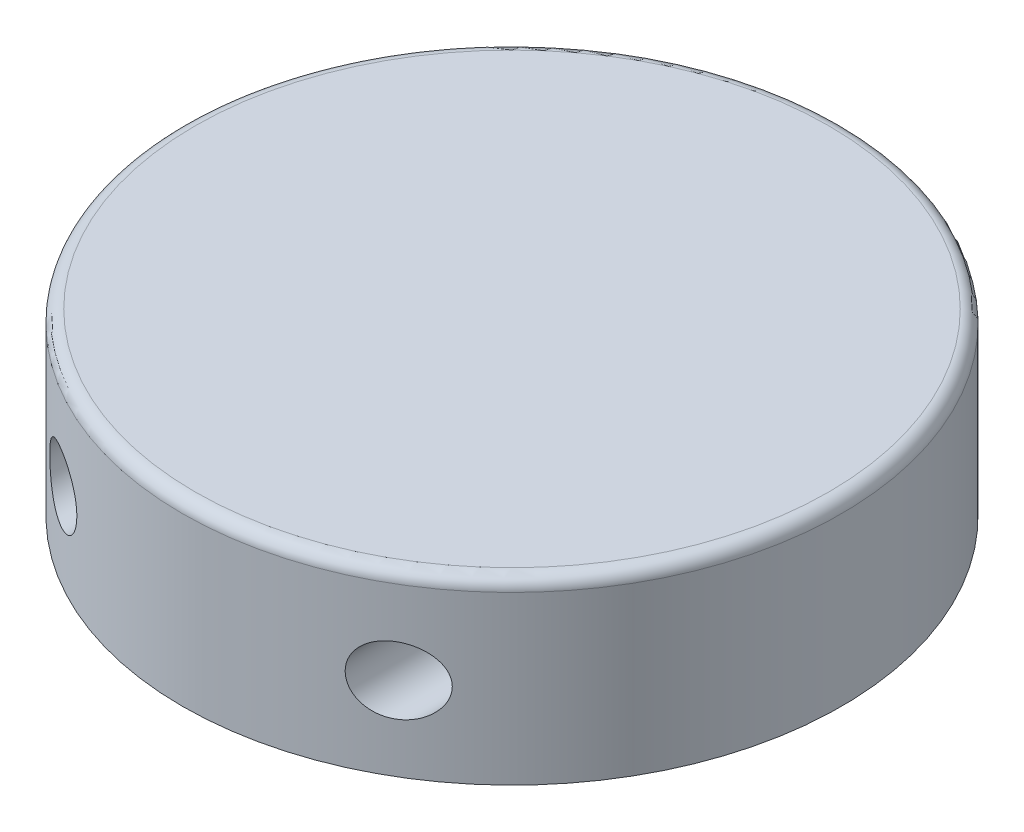
ISO-10303-21;
HEADER;
FILE_DESCRIPTION(('STEP AP214'),'2;1');
FILE_NAME('part.step','',(''),(''),'','','');
FILE_SCHEMA(('AUTOMOTIVE_DESIGN { 1 0 10303 214 1 1 1 1 }'));
ENDSEC;
DATA;
#1=APPLICATION_CONTEXT('core data for automotive mechanical design processes');
#2=APPLICATION_PROTOCOL_DEFINITION('international standard','automotive_design',2000,#1);
#3=PRODUCT_CONTEXT('',#1,'mechanical');
#4=PRODUCT('Part','Part','',(#3));
#5=PRODUCT_RELATED_PRODUCT_CATEGORY('part','',(#4));
#6=PRODUCT_DEFINITION_FORMATION('','',#4);
#7=PRODUCT_DEFINITION_CONTEXT('part definition',#1,'design');
#8=PRODUCT_DEFINITION('design','',#6,#7);
#9=PRODUCT_DEFINITION_SHAPE('','',#8);
#10=(LENGTH_UNIT() NAMED_UNIT(*) SI_UNIT(.MILLI.,.METRE.));
#11=(NAMED_UNIT(*) PLANE_ANGLE_UNIT() SI_UNIT($,.RADIAN.));
#12=(NAMED_UNIT(*) SI_UNIT($,.STERADIAN.) SOLID_ANGLE_UNIT());
#13=UNCERTAINTY_MEASURE_WITH_UNIT(LENGTH_MEASURE(1.E-05),#10,'distance_accuracy_value','');
#14=(GEOMETRIC_REPRESENTATION_CONTEXT(3) GLOBAL_UNCERTAINTY_ASSIGNED_CONTEXT((#13)) GLOBAL_UNIT_ASSIGNED_CONTEXT((#10,
#11,#12)) REPRESENTATION_CONTEXT('',''));
#15=CARTESIAN_POINT('',(0.,0.,0.));
#16=DIRECTION('',(0.,0.,1.));
#17=DIRECTION('',(1.,0.,0.));
#18=AXIS2_PLACEMENT_3D('',#15,#16,#17);
#19=CARTESIAN_POINT('',(0.,21.4,0.));
#20=DIRECTION('',(0.,-1.,0.));
#21=DIRECTION('',(0.,0.,-1.));
#22=AXIS2_PLACEMENT_3D('',#19,#20,#21);
#23=CYLINDRICAL_SURFACE('',#22,39.3);
#24=CARTESIAN_POINT('',(24.,9.94999999999997,31.1205719741781));
#25=CARTESIAN_POINT('',(24.0000004367337,9.75702235025103,31.1205716483451));
#26=CARTESIAN_POINT('',(23.9859498878768,9.56404571600808,31.1314224845735));
#27=CARTESIAN_POINT('',(23.9307323153177,9.18437149414656,31.1738868124886));
#28=CARTESIAN_POINT('',(23.889554633807,8.99767640475851,31.2055084646763));
#29=CARTESIAN_POINT('',(23.7829266022278,8.63670399423492,31.2868473359323));
#30=CARTESIAN_POINT('',(23.7175976432236,8.46236968013503,31.3364740337929));
#31=CARTESIAN_POINT('',(23.56591285891,8.12848015842301,31.4507032763606));
#32=CARTESIAN_POINT('',(23.4795504893609,7.9689295719222,31.5153104817342));
#33=CARTESIAN_POINT('',(23.2810537998613,7.65386834507642,31.6622644846472));
#34=CARTESIAN_POINT('',(23.1673608424185,7.49983155229876,31.7456474743854));
#35=CARTESIAN_POINT('',(22.9228514518291,7.21274960495519,31.9226517859381));
#36=CARTESIAN_POINT('',(22.7920271726797,7.0797141307694,32.016277795718));
#37=CARTESIAN_POINT('',(22.4886637812432,6.81065461097024,32.2302796034445));
#38=CARTESIAN_POINT('',(22.3130230727105,6.6793937134958,32.3522518750715));
#39=CARTESIAN_POINT('',(21.94598573118,6.44854278442323,32.6023487306357));
#40=CARTESIAN_POINT('',(21.7545776645915,6.34897599464994,32.7304777505384));
#41=CARTESIAN_POINT('',(21.3275209999802,6.16848395247953,33.0106375022933));
#42=CARTESIAN_POINT('',(21.0897588773783,6.09327668944546,33.1631480130952));
#43=CARTESIAN_POINT('',(20.6036253190854,5.98799899532425,33.4673383585911));
#44=CARTESIAN_POINT('',(20.3552486839697,5.95795095186154,33.6190177441569));
#45=CARTESIAN_POINT('',(19.9725838712759,5.94790055574151,33.8468582559754));
#46=CARTESIAN_POINT('',(19.8396864734694,5.95098780086743,33.9249249843817));
#47=CARTESIAN_POINT('',(19.573739423672,5.97054550202568,34.0790591570475));
#48=CARTESIAN_POINT('',(19.4406898587151,5.98701035463219,34.1551274246252));
#49=CARTESIAN_POINT('',(19.1754853954293,6.03358426834627,34.3047221863499));
#50=CARTESIAN_POINT('',(19.0433308395354,6.06369828204682,34.378247747445));
#51=CARTESIAN_POINT('',(18.7812618906078,6.13775619152729,34.5221164375005));
#52=CARTESIAN_POINT('',(18.6513462566428,6.18169214819713,34.5924613669044));
#53=CARTESIAN_POINT('',(18.403090890259,6.28031524591406,34.7251321387838));
#54=CARTESIAN_POINT('',(18.2845359828487,6.3341559146246,34.7876842490207));
#55=CARTESIAN_POINT('',(18.0518201313635,6.45404308371528,34.9090102518675));
#56=CARTESIAN_POINT('',(17.9376568140551,6.52008287641596,34.9677861969774));
#57=CARTESIAN_POINT('',(17.715029480331,6.66419947243356,35.0810964499967));
#58=CARTESIAN_POINT('',(17.6065629619296,6.74227093125897,35.1356326251172));
#59=CARTESIAN_POINT('',(17.3966771906184,6.91013825072774,35.2400249478298));
#60=CARTESIAN_POINT('',(17.2952568268871,6.9999322568638,35.2898818335456));
#61=CARTESIAN_POINT('',(17.1129078985375,7.17890877820417,35.3786286616791));
#62=CARTESIAN_POINT('',(17.0309955888393,7.26679676310176,35.4181125613419));
#63=CARTESIAN_POINT('',(16.8746549624477,7.45064549013117,35.4928658601843));
#64=CARTESIAN_POINT('',(16.8002255303775,7.54660502521217,35.5281358876201));
#65=CARTESIAN_POINT('',(16.6598301750251,7.74588712005912,35.5941860126814));
#66=CARTESIAN_POINT('',(16.5938592250628,7.84920524945849,35.6249687784863));
#67=CARTESIAN_POINT('',(16.4712229092875,8.0624474489991,35.6818355493655));
#68=CARTESIAN_POINT('',(16.4145565690073,8.1723708257268,35.7079200465151));
#69=CARTESIAN_POINT('',(16.3171344455011,8.38519331690116,35.752533659173));
#70=CARTESIAN_POINT('',(16.2753064246444,8.48749432657372,35.771582347638));
#71=CARTESIAN_POINT('',(16.2001015603304,8.69579534509265,35.8057036879036));
#72=CARTESIAN_POINT('',(16.1667238642029,8.80179497950456,35.8207767408674));
#73=CARTESIAN_POINT('',(16.1088299521118,9.01663562301356,35.8468493261039));
#74=CARTESIAN_POINT('',(16.0843105371636,9.12547559112743,35.8578503289485));
#75=CARTESIAN_POINT('',(16.0444189603798,9.34515368114454,35.875717412209));
#76=CARTESIAN_POINT('',(16.0290464721834,9.45599173161113,35.8825836401532));
#77=CARTESIAN_POINT('',(16.0083463654044,9.67138845944432,35.8918230870908));
#78=CARTESIAN_POINT('',(16.0024229313056,9.77587895581515,35.8944628533587));
#79=CARTESIAN_POINT('',(15.9987856528215,9.98506750787086,35.8960842204553));
#80=CARTESIAN_POINT('',(16.0010744970963,10.0897656203137,35.895064623226));
#81=CARTESIAN_POINT('',(16.0138399684754,10.2985058317393,35.88937137729));
#82=CARTESIAN_POINT('',(16.0243123199287,10.4025482446997,35.8846996367243));
#83=CARTESIAN_POINT('',(16.0533286748346,10.6093095676124,35.871728285886));
#84=CARTESIAN_POINT('',(16.0718756602008,10.7120279741747,35.8634273353634));
#85=CARTESIAN_POINT('',(16.1164701809595,10.9136783936685,35.843409104268));
#86=CARTESIAN_POINT('',(16.1423877682993,11.012644970687,35.8317509714357));
#87=CARTESIAN_POINT('',(16.2015639810518,11.2078991889282,35.8050327728986));
#88=CARTESIAN_POINT('',(16.2348252241386,11.3041858610725,35.7899714940845));
#89=CARTESIAN_POINT('',(16.3451337594465,11.5880000960856,35.7397981726284));
#90=CARTESIAN_POINT('',(16.4327499466903,11.7706785711117,35.6996771156622));
#91=CARTESIAN_POINT('',(16.6355260115283,12.1232214652335,35.6056461831859));
#92=CARTESIAN_POINT('',(16.7513931649307,12.2925790300543,35.5513792568576));
#93=CARTESIAN_POINT('',(17.0049978429257,12.6091553448522,35.4307738955639));
#94=CARTESIAN_POINT('',(17.1427405334429,12.7563688494633,35.3644326086877));
#95=CARTESIAN_POINT('',(17.4455511320463,13.035455861771,35.2160901602475));
#96=CARTESIAN_POINT('',(17.6118433547985,13.1655925902241,35.1333284721708));
#97=CARTESIAN_POINT('',(17.9587281337197,13.3962512310725,34.9572874761152));
#98=CARTESIAN_POINT('',(18.1393260825743,13.4967619075816,34.8640041962468));
#99=CARTESIAN_POINT('',(18.5285877848544,13.6763135902414,34.6588303591607));
#100=CARTESIAN_POINT('',(18.7382407173076,13.7521451393071,34.5460121515003));
#101=CARTESIAN_POINT('',(19.1628838342106,13.8676166385126,34.3122826126043));
#102=CARTESIAN_POINT('',(19.3778762597849,13.9072411185971,34.191367845642));
#103=CARTESIAN_POINT('',(19.8331708788641,13.9538002472475,33.9295143068437));
#104=CARTESIAN_POINT('',(20.07351691554,13.9564111346466,33.7878795024511));
#105=CARTESIAN_POINT('',(20.5488041126521,13.9193469252747,33.5009534082908));
#106=CARTESIAN_POINT('',(20.7837413224327,13.8796418627614,33.3556595986066));
#107=CARTESIAN_POINT('',(21.2638434376475,13.7539124791498,33.0518791894045));
#108=CARTESIAN_POINT('',(21.5080015434858,13.6640115305599,32.8933919704275));
#109=CARTESIAN_POINT('',(21.9771466624118,13.4369427129619,32.5818085680769));
#110=CARTESIAN_POINT('',(22.202138244206,13.2997861477747,32.4287111050862));
#111=CARTESIAN_POINT('',(22.5905118296975,13.0058701989524,32.1590606450284));
#112=CARTESIAN_POINT('',(22.757924195903,12.8561291827068,32.0406566967842));
#113=CARTESIAN_POINT('',(23.0690991625218,12.5252756655424,31.8173414739471));
#114=CARTESIAN_POINT('',(23.212892104453,12.3442040361057,31.712412927279));
#115=CARTESIAN_POINT('',(23.446847389397,11.9885953290825,31.5396978978216));
#116=CARTESIAN_POINT('',(23.5420090420954,11.8189512055665,31.468628912211));
#117=CARTESIAN_POINT('',(23.7082716798775,11.4623842719858,31.3435591699238));
#118=CARTESIAN_POINT('',(23.7793927375086,11.2754760433496,31.2895441766191));
#119=CARTESIAN_POINT('',(23.8898131319358,10.9012448013563,31.2053102193634));
#120=CARTESIAN_POINT('',(23.9308937589321,10.7147531592331,31.1737627971324));
#121=CARTESIAN_POINT('',(23.9859809503328,10.3355054558359,31.1313984502066));
#122=CARTESIAN_POINT('',(23.9999995637765,10.1427522213505,31.1205722996304));
#123=CARTESIAN_POINT('',(24.,9.94999999999997,31.1205719741781));
#124=B_SPLINE_CURVE_WITH_KNOTS('',3,(#24,#25,#26,#27,#28,#29,#30,#31,#32,#33,#34,#35,#36,#37,
#38,#39,#40,#41,#42,#43,#44,#45,#46,#47,#48,#49,#50,#51,#52,#53,#54,#55,#56,#57,#58,#59,#60,#61,
#62,#63,#64,#65,#66,#67,#68,#69,#70,#71,#72,#73,#74,#75,#76,#77,#78,#79,#80,#81,#82,#83,#84,#85,
#86,#87,#88,#89,#90,#91,#92,#93,#94,#95,#96,#97,#98,#99,#100,#101,#102,#103,#104,#105,#106,#107,
#108,#109,#110,#111,#112,#113,#114,#115,#116,#117,#118,#119,#120,#121,#122,#123),.UNSPECIFIED.,
.T.,.F.,(4,2,2,2,2,2,2,2,2,2,2,2,2,2,2,2,2,2,2,2,2,2,2,2,2,2,2,2,2,2,2,2,2,2,2,2,2,2,2,2,2,2,2,
2,2,2,2,2,2,4),(0.,0.578149471992341,1.15652622506883,1.73203456710251,2.30772219945241,
2.93192979410053,3.55642427708915,4.30630707215368,5.05673850885305,5.92998935051802,
6.80367296251658,7.2656598486744,7.72745332390251,8.18941449502801,8.65111080578781,
9.08386875035925,9.51638944777527,9.94871856943401,10.3809793793074,10.7598461833672,
11.1386564306074,11.5172405058395,11.8957849068196,12.2318047631017,12.5677907001704,
12.9036551813165,13.2395076781537,13.553201590839,13.8669982147617,14.1806309983518,
14.4943797030089,14.8029074965375,15.1115454440443,15.7282211415504,16.3622930865178,
16.9965149913174,17.6740957952512,18.3519332467425,19.0984869885765,19.8453595586123,
20.6788435549317,21.5129181694982,22.4226882178029,23.3322407946909,24.0910198056273,
24.8488163341647,25.4676210184011,26.0859077518268,26.6636391412548,27.2411132432772),.UNSPECIFIED.);
#125=CARTESIAN_POINT('',(24.,9.94999999999997,31.1205719741781));
#126=VERTEX_POINT('',#125);
#127=EDGE_CURVE('E34',#126,#126,#124,.T.);
#128=ORIENTED_EDGE('',*,*,#127,.T.);
#129=EDGE_LOOP('',(#128));
#130=FACE_BOUND('',#129,.T.);
#131=CARTESIAN_POINT('',(-16.,9.95,35.8955428988057));
#132=CARTESIAN_POINT('',(-15.9999997590268,9.8452241676736,35.8955429740728));
#133=CARTESIAN_POINT('',(-16.0041203515562,9.74045176538424,35.8937071436146));
#134=CARTESIAN_POINT('',(-16.0205593282236,9.53164235725571,35.8863729023838));
#135=CARTESIAN_POINT('',(-16.0328806404591,9.42760562750506,35.8808731834055));
#136=CARTESIAN_POINT('',(-16.0655807671828,9.22111987173641,35.8662436603464));
#137=CARTESIAN_POINT('',(-16.0859555719473,9.11867008194113,35.8571156627231));
#138=CARTESIAN_POINT('',(-16.1345493832768,8.91599969226433,35.8352762657919));
#139=CARTESIAN_POINT('',(-16.1627713782482,8.81577995737845,35.8225635012888));
#140=CARTESIAN_POINT('',(-16.2267034485003,8.61847337278842,35.793649191483));
#141=CARTESIAN_POINT('',(-16.2624000462627,8.52138124239186,35.7774539241133));
#142=CARTESIAN_POINT('',(-16.3409377601621,8.3307689568906,35.7416509631829));
#143=CARTESIAN_POINT('',(-16.3837815144312,8.23725013647683,35.7220420094578));
#144=CARTESIAN_POINT('',(-16.5223934258558,7.96301715940687,35.6582511230244));
#145=CARTESIAN_POINT('',(-16.6283033938818,7.78843997131337,35.60907782747));
#146=CARTESIAN_POINT('',(-16.86640588436,7.45524923736447,35.4969307822579));
#147=CARTESIAN_POINT('',(-16.9992658559993,7.29723813032526,35.4336012583432));
#148=CARTESIAN_POINT('',(-17.2845264952018,7.00589041134208,35.2953290462837));
#149=CARTESIAN_POINT('',(-17.4369320004669,6.87255992811248,35.2203834820997));
#150=CARTESIAN_POINT('',(-17.7693900964558,6.62268309348768,35.0539011446319));
#151=CARTESIAN_POINT('',(-17.9506809932971,6.50835610464575,34.9615139462921));
#152=CARTESIAN_POINT('',(-18.3248233851184,6.31152155102385,34.7668718240715));
#153=CARTESIAN_POINT('',(-18.5176797776453,6.22902757782599,34.6646127084723));
#154=CARTESIAN_POINT('',(-18.9312799955535,6.08857832093468,34.4406402100228));
#155=CARTESIAN_POINT('',(-19.1527726653748,6.03427653987141,34.3180211642214));
#156=CARTESIAN_POINT('',(-19.597819931862,5.96388942002956,34.0658334614784));
#157=CARTESIAN_POINT('',(-19.8213753592222,5.94782021837472,33.9362618936168));
#158=CARTESIAN_POINT('',(-20.290787292332,5.95292658298172,33.6579334111187));
#159=CARTESIAN_POINT('',(-20.5362980016612,5.97853222537199,33.5086670807192));
#160=CARTESIAN_POINT('',(-21.0179015174898,6.07389082605452,33.2087107346837));
#161=CARTESIAN_POINT('',(-21.2539860627186,6.14368164377712,33.0580196074133));
#162=CARTESIAN_POINT('',(-21.7269146054713,6.33240272033566,32.7492939886718));
#163=CARTESIAN_POINT('',(-21.9626856065747,6.4543930642128,32.5914708375228));
#164=CARTESIAN_POINT('',(-22.4097882739966,6.74624335531925,32.2856712236157));
#165=CARTESIAN_POINT('',(-22.621142736572,6.91605813397047,32.1376856318433));
#166=CARTESIAN_POINT('',(-22.9636175743543,7.25551823612834,31.8935007645904));
#167=CARTESIAN_POINT('',(-23.1017845127615,7.41528815125126,31.7934289202936));
#168=CARTESIAN_POINT('',(-23.3542570537494,7.76035712436593,31.6084338452837));
#169=CARTESIAN_POINT('',(-23.4685962945082,7.94561957152517,31.5234892839918));
#170=CARTESIAN_POINT('',(-23.65174074486,8.30717582102311,31.386241335142));
#171=CARTESIAN_POINT('',(-23.7249223513613,8.48005688531432,31.3308789989845));
#172=CARTESIAN_POINT('',(-23.8165845199701,8.74888271207731,31.2611861863408));
#173=CARTESIAN_POINT('',(-23.844125644384,8.84010362900811,31.2401761442257));
#174=CARTESIAN_POINT('',(-23.8927953579865,9.02518425010417,31.2029689816648));
#175=CARTESIAN_POINT('',(-23.9139266084386,9.119042841421,31.186769863869));
#176=CARTESIAN_POINT('',(-23.9495439526221,9.30928088950401,31.15942637837));
#177=CARTESIAN_POINT('',(-23.9639931005196,9.40567131936796,31.1483101178774));
#178=CARTESIAN_POINT('',(-23.9858248023284,9.59968052915269,31.1315017242336));
#179=CARTESIAN_POINT('',(-23.9932103925649,9.69729876299313,31.1258072604856));
#180=CARTESIAN_POINT('',(-24.0007919758527,9.89298179341872,31.1199615648758));
#181=CARTESIAN_POINT('',(-24.0009878732636,9.99104659592695,31.1198104067535));
#182=CARTESIAN_POINT('',(-23.9941867332155,10.1867717114217,31.1250545581334));
#183=CARTESIAN_POINT('',(-23.9871901110963,10.2844320474377,31.1304495473674));
#184=CARTESIAN_POINT('',(-23.9670163841337,10.4703583702251,31.145983242021));
#185=CARTESIAN_POINT('',(-23.9544088355226,10.5587234096677,31.1556846190009));
#186=CARTESIAN_POINT('',(-23.9234540584677,10.7338555762378,31.1794599200386));
#187=CARTESIAN_POINT('',(-23.9051049032513,10.8206221565881,31.1935353119209));
#188=CARTESIAN_POINT('',(-23.8418034686287,11.0776556197208,31.2419793212755));
#189=CARTESIAN_POINT('',(-23.7885802291006,11.2448079774847,31.2825789980546));
#190=CARTESIAN_POINT('',(-23.6595059569021,11.5751394769483,31.3803217236845));
#191=CARTESIAN_POINT('',(-23.5826601080023,11.7377062699671,31.4381879060522));
#192=CARTESIAN_POINT('',(-23.4106241754608,12.0473902474425,31.566504238692));
#193=CARTESIAN_POINT('',(-23.3154258654073,12.194500457692,31.6369600311634));
#194=CARTESIAN_POINT('',(-23.0926464677439,12.4948022217316,31.8000263779702));
#195=CARTESIAN_POINT('',(-22.9623142183741,12.6450016721065,31.8943745520976));
#196=CARTESIAN_POINT('',(-22.6847111766128,12.9216643895771,32.0924137144742));
#197=CARTESIAN_POINT('',(-22.5374293015192,13.0481119824119,32.1961108059105));
#198=CARTESIAN_POINT('',(-22.1989355010781,13.2992332091225,32.4306558976864));
#199=CARTESIAN_POINT('',(-22.0047733816675,13.4186936790644,32.5628397812804));
#200=CARTESIAN_POINT('',(-21.6015814255864,13.6223290110125,32.8316999034053));
#201=CARTESIAN_POINT('',(-21.3925418013529,13.7064803882694,32.9683790668774));
#202=CARTESIAN_POINT('',(-20.9339068922711,13.8478396848077,33.2617724639513));
#203=CARTESIAN_POINT('',(-20.6827218536969,13.8996519593967,33.4186219853555));
#204=CARTESIAN_POINT('',(-20.17268648017,13.9544838533758,33.7289439402963));
#205=CARTESIAN_POINT('',(-19.9138334203867,13.9574859145432,33.8824151387434));
#206=CARTESIAN_POINT('',(-19.5230245434659,13.9236768459091,34.1081369981305));
#207=CARTESIAN_POINT('',(-19.3909578094257,13.905629536593,34.1833819674401));
#208=CARTESIAN_POINT('',(-19.127919102916,13.8560671263425,34.3312596902795));
#209=CARTESIAN_POINT('',(-18.996946640993,13.8245584160988,34.4038936656409));
#210=CARTESIAN_POINT('',(-18.7372752314352,13.747875975991,34.5460048092086));
#211=CARTESIAN_POINT('',(-18.6085766663026,13.7026999698226,34.6154814493382));
#212=CARTESIAN_POINT('',(-18.3548889447417,13.5986147053033,34.7506645445328));
#213=CARTESIAN_POINT('',(-18.2298975446923,13.5397139527532,34.8163733034107));
#214=CARTESIAN_POINT('',(-17.9957658188257,13.4139752012455,34.9379201665303));
#215=CARTESIAN_POINT('',(-17.8861961207279,13.3482845792796,34.9941186993216));
#216=CARTESIAN_POINT('',(-17.6725725432267,13.2056965019734,35.1024858626098));
#217=CARTESIAN_POINT('',(-17.5685155542712,13.1288054582453,35.1546567727268));
#218=CARTESIAN_POINT('',(-17.3671692039451,12.9641511177057,35.2545608813468));
#219=CARTESIAN_POINT('',(-17.26987656358,12.8763931467908,35.3022962338005));
#220=CARTESIAN_POINT('',(-17.0833088767408,12.690483005975,35.3929557291461));
#221=CARTESIAN_POINT('',(-16.9940326266389,12.592332401324,35.4358805945536));
#222=CARTESIAN_POINT('',(-16.8355067607713,12.399396082961,35.5114407322839));
#223=CARTESIAN_POINT('',(-16.7651525181401,12.3057563583906,35.5446907165828));
#224=CARTESIAN_POINT('',(-16.6323839157283,12.1117069629072,35.6070103182686));
#225=CARTESIAN_POINT('',(-16.5699684361678,12.0112982498387,35.6360805252977));
#226=CARTESIAN_POINT('',(-16.4538865693652,11.8044904344524,35.689826414825));
#227=CARTESIAN_POINT('',(-16.4002160325603,11.6980942057057,35.7145041820963));
#228=CARTESIAN_POINT('',(-16.3023011586262,11.4801285834805,35.7593047926747));
#229=CARTESIAN_POINT('',(-16.2580561870312,11.3685595388175,35.7794279425738));
#230=CARTESIAN_POINT('',(-16.1829520576759,11.1509343810072,35.8134557654775));
#231=CARTESIAN_POINT('',(-16.1512726959219,11.0452205533894,35.8277446115374));
#232=CARTESIAN_POINT('',(-16.0966733210929,10.8310534774523,35.8523082461964));
#233=CARTESIAN_POINT('',(-16.0737563218202,10.7225993002424,35.862581653718));
#234=CARTESIAN_POINT('',(-16.0369912904516,10.503936326009,35.8790372857185));
#235=CARTESIAN_POINT('',(-16.0231369713782,10.3937287998023,35.8852223464035));
#236=CARTESIAN_POINT('',(-16.0046397655823,10.1723464549534,35.8934758675689));
#237=CARTESIAN_POINT('',(-16.000000255682,10.0611712967006,35.8955428189443));
#238=CARTESIAN_POINT('',(-16.,9.95,35.8955428988057));
#239=B_SPLINE_CURVE_WITH_KNOTS('',3,(#131,#132,#133,#134,#135,#136,#137,#138,#139,#140,#141,
#142,#143,#144,#145,#146,#147,#148,#149,#150,#151,#152,#153,#154,#155,#156,#157,#158,#159,#160,
#161,#162,#163,#164,#165,#166,#167,#168,#169,#170,#171,#172,#173,#174,#175,#176,#177,#178,#179,
#180,#181,#182,#183,#184,#185,#186,#187,#188,#189,#190,#191,#192,#193,#194,#195,#196,#197,#198,
#199,#200,#201,#202,#203,#204,#205,#206,#207,#208,#209,#210,#211,#212,#213,#214,#215,#216,#217,
#218,#219,#220,#221,#222,#223,#224,#225,#226,#227,#228,#229,#230,#231,#232,#233,#234,#235,#236,
#237,#238),.UNSPECIFIED.,.T.,.F.,(4,2,2,2,2,2,2,2,2,2,2,2,2,2,2,2,2,2,2,2,2,2,2,2,2,2,2,2,2,2,2,
2,2,2,2,2,2,2,2,2,2,2,2,2,2,2,2,2,2,2,2,2,2,4),(0.,0.314224840128568,0.628561935638139,
0.942742723752898,1.25704332403378,1.57078201254982,1.88463676441975,2.51175892594269,
3.15689119248138,3.80218344455805,4.49949297354393,5.1970999007053,5.97072423722214,
6.74467504553067,7.60638953948094,8.46884338218571,9.39084447615308,10.311977674553,
11.0105182444218,11.7080658841732,12.2925612133865,12.5849811880133,12.8772795884662,
13.1711753546901,13.4649447306695,13.7587180144911,14.0524743350103,14.3215140964364,
14.5906442394299,15.1284501597711,15.6930371976354,16.2578779001295,16.9157901868636,
17.5741351275752,18.3616163913344,19.1496205967762,20.0475424097216,20.9457872198704,
21.4044730254817,21.8629413152867,22.3214860056075,22.7797472688509,23.1978627377922,
23.6157397929201,24.0334128505317,24.451023091033,24.8157858498291,25.1804971008502,
25.5450347855477,25.9095479242512,26.2429478231615,26.5764622915645,26.9097451477034,
27.2431501148317),.UNSPECIFIED.);
#240=CARTESIAN_POINT('',(-16.,9.95,35.8955428988057));
#241=VERTEX_POINT('',#240);
#242=EDGE_CURVE('E50',#241,#241,#239,.T.);
#243=ORIENTED_EDGE('',*,*,#242,.T.);
#244=EDGE_LOOP('',(#243));
#245=FACE_BOUND('',#244,.T.);
#246=CARTESIAN_POINT('',(0.,19.9,0.));
#247=DIRECTION('',(0.,1.,0.));
#248=DIRECTION('',(0.,0.,1.));
#249=AXIS2_PLACEMENT_3D('',#246,#247,#248);
#250=CIRCLE('',#249,39.3);
#251=CARTESIAN_POINT('',(0.,19.9,39.3));
#252=VERTEX_POINT('',#251);
#253=EDGE_CURVE('E10',#252,#252,#250,.F.);
#254=ORIENTED_EDGE('',*,*,#253,.T.);
#255=EDGE_LOOP('',(#254));
#256=FACE_BOUND('',#255,.T.);
#257=CARTESIAN_POINT('',(0.,0.,0.));
#258=DIRECTION('',(0.,1.,0.));
#259=DIRECTION('',(0.,0.,1.));
#260=AXIS2_PLACEMENT_3D('',#257,#258,#259);
#261=CIRCLE('',#260,39.3);
#262=CARTESIAN_POINT('',(0.,0.,39.3));
#263=VERTEX_POINT('',#262);
#264=EDGE_CURVE('E47',#263,#263,#261,.T.);
#265=ORIENTED_EDGE('',*,*,#264,.T.);
#266=EDGE_LOOP('',(#265));
#267=FACE_BOUND('',#266,.T.);
#268=ADVANCED_FACE('F30',(#130,#245,#256,#267),#23,.T.);
#269=CARTESIAN_POINT('',(0.,21.4,0.));
#270=DIRECTION('',(0.,1.,0.));
#271=DIRECTION('',(0.,0.,1.));
#272=AXIS2_PLACEMENT_3D('',#269,#270,#271);
#273=PLANE('',#272);
#274=CARTESIAN_POINT('',(0.,21.4,0.));
#275=DIRECTION('',(0.,1.,0.));
#276=DIRECTION('',(0.,0.,1.));
#277=AXIS2_PLACEMENT_3D('',#274,#275,#276);
#278=CIRCLE('',#277,37.8);
#279=CARTESIAN_POINT('',(0.,21.4,37.8));
#280=VERTEX_POINT('',#279);
#281=EDGE_CURVE('E42',#280,#280,#278,.T.);
#282=ORIENTED_EDGE('',*,*,#281,.T.);
#283=EDGE_LOOP('',(#282));
#284=FACE_BOUND('',#283,.T.);
#285=ADVANCED_FACE('F66',(#284),#273,.T.);
#286=CARTESIAN_POINT('',(0.,0.,0.));
#287=DIRECTION('',(0.,1.,0.));
#288=DIRECTION('',(0.,0.,1.));
#289=AXIS2_PLACEMENT_3D('',#286,#287,#288);
#290=PLANE('',#289);
#291=ORIENTED_EDGE('',*,*,#264,.F.);
#292=EDGE_LOOP('',(#291));
#293=FACE_BOUND('',#292,.T.);
#294=ADVANCED_FACE('F68',(#293),#290,.F.);
#295=CARTESIAN_POINT('',(0.,19.9,0.));
#296=DIRECTION('',(0.,1.,0.));
#297=DIRECTION('',(0.,0.,1.));
#298=AXIS2_PLACEMENT_3D('',#295,#296,#297);
#299=TOROIDAL_SURFACE('',#298,37.8,1.5);
#300=ORIENTED_EDGE('',*,*,#253,.F.);
#301=EDGE_LOOP('',(#300));
#302=FACE_BOUND('',#301,.T.);
#303=ORIENTED_EDGE('',*,*,#281,.F.);
#304=EDGE_LOOP('',(#303));
#305=FACE_BOUND('',#304,.T.);
#306=ADVANCED_FACE('F32',(#302,#305),#299,.T.);
#307=CARTESIAN_POINT('',(-20.,9.95,-10.7));
#308=DIRECTION('',(0.,0.,1.));
#309=DIRECTION('',(1.,0.,0.));
#310=AXIS2_PLACEMENT_3D('',#307,#308,#309);
#311=CYLINDRICAL_SURFACE('',#310,4.);
#312=CARTESIAN_POINT('',(-20.,9.95,-10.7));
#313=DIRECTION('',(0.,0.,1.));
#314=DIRECTION('',(1.,0.,0.));
#315=AXIS2_PLACEMENT_3D('',#312,#313,#314);
#316=CIRCLE('',#315,4.);
#317=CARTESIAN_POINT('',(-16.,9.95,-10.7));
#318=VERTEX_POINT('',#317);
#319=EDGE_CURVE('E56',#318,#318,#316,.T.);
#320=ORIENTED_EDGE('',*,*,#319,.F.);
#321=EDGE_LOOP('',(#320));
#322=FACE_BOUND('',#321,.T.);
#323=ORIENTED_EDGE('',*,*,#242,.F.);
#324=EDGE_LOOP('',(#323));
#325=FACE_BOUND('',#324,.T.);
#326=ADVANCED_FACE('F59',(#322,#325),#311,.F.);
#327=CARTESIAN_POINT('',(-20.,9.95,-10.7));
#328=DIRECTION('',(0.,0.,1.));
#329=DIRECTION('',(1.,0.,0.));
#330=AXIS2_PLACEMENT_3D('',#327,#328,#329);
#331=PLANE('',#330);
#332=ORIENTED_EDGE('',*,*,#319,.T.);
#333=EDGE_LOOP('',(#332));
#334=FACE_BOUND('',#333,.T.);
#335=ADVANCED_FACE('F64',(#334),#331,.T.);
#336=CARTESIAN_POINT('',(20.,9.94999999999997,-10.7));
#337=DIRECTION('',(0.,0.,1.));
#338=DIRECTION('',(1.,0.,0.));
#339=AXIS2_PLACEMENT_3D('',#336,#337,#338);
#340=CYLINDRICAL_SURFACE('',#339,4.);
#341=CARTESIAN_POINT('',(20.,9.94999999999997,-10.7));
#342=DIRECTION('',(0.,0.,1.));
#343=DIRECTION('',(-1.,0.,0.));
#344=AXIS2_PLACEMENT_3D('',#341,#342,#343);
#345=CIRCLE('',#344,4.);
#346=CARTESIAN_POINT('',(16.,9.94999999999997,-10.7));
#347=VERTEX_POINT('',#346);
#348=EDGE_CURVE('E90',#347,#347,#345,.T.);
#349=ORIENTED_EDGE('',*,*,#348,.F.);
#350=EDGE_LOOP('',(#349));
#351=FACE_BOUND('',#350,.T.);
#352=ORIENTED_EDGE('',*,*,#127,.F.);
#353=EDGE_LOOP('',(#352));
#354=FACE_BOUND('',#353,.T.);
#355=ADVANCED_FACE('F96',(#351,#354),#340,.F.);
#356=CARTESIAN_POINT('',(20.,9.94999999999997,-10.7));
#357=DIRECTION('',(0.,0.,-1.));
#358=DIRECTION('',(-1.,0.,0.));
#359=AXIS2_PLACEMENT_3D('',#356,#357,#358);
#360=PLANE('',#359);
#361=ORIENTED_EDGE('',*,*,#348,.T.);
#362=EDGE_LOOP('',(#361));
#363=FACE_BOUND('',#362,.T.);
#364=ADVANCED_FACE('F94',(#363),#360,.F.);
#365=CLOSED_SHELL('',(#268,#285,#294,#306,#326,#335,#355,#364));
#366=MANIFOLD_SOLID_BREP('B2',#365);
#367=ADVANCED_BREP_SHAPE_REPRESENTATION('',(#18,#366),#14);
#368=SHAPE_DEFINITION_REPRESENTATION(#9,#367);
ENDSEC;
END-ISO-10303-21;
